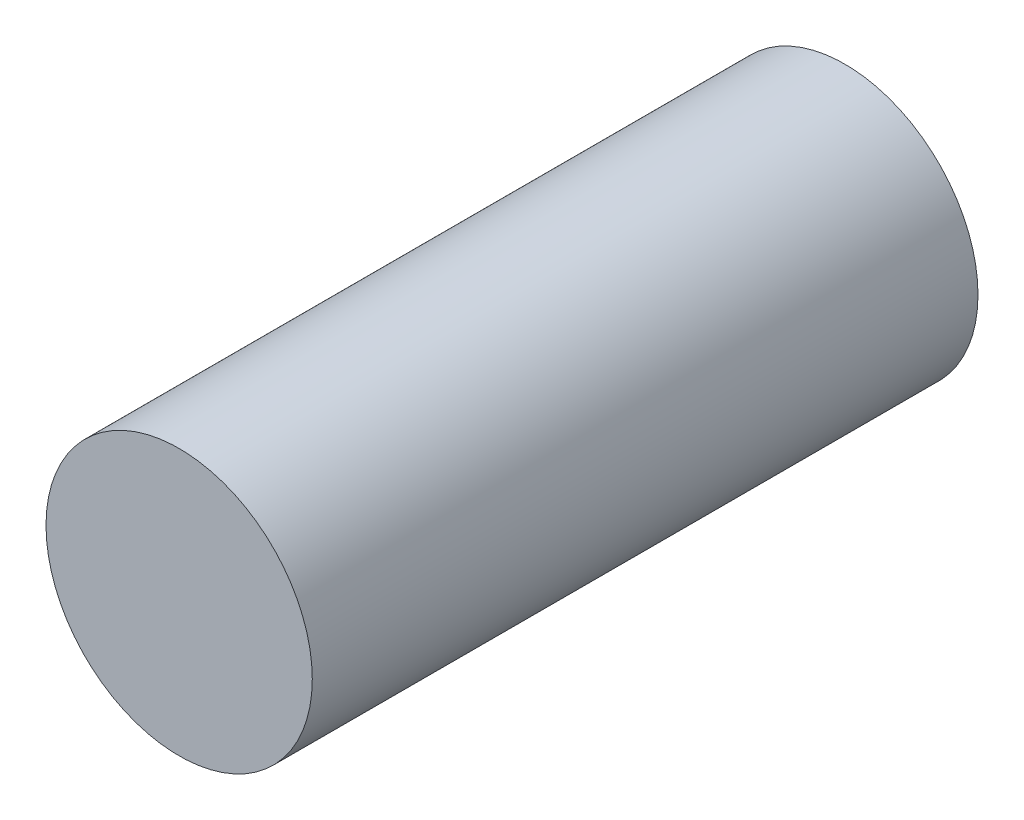
ISO-10303-21;
HEADER;
FILE_DESCRIPTION(('STEP AP214'),'2;1');
FILE_NAME('part.step','',(''),(''),'','','');
FILE_SCHEMA(('AUTOMOTIVE_DESIGN { 1 0 10303 214 1 1 1 1 }'));
ENDSEC;
DATA;
#1=APPLICATION_CONTEXT('core data for automotive mechanical design processes');
#2=APPLICATION_PROTOCOL_DEFINITION('international standard','automotive_design',2000,#1);
#3=PRODUCT_CONTEXT('',#1,'mechanical');
#4=PRODUCT('Part','Part','',(#3));
#5=PRODUCT_RELATED_PRODUCT_CATEGORY('part','',(#4));
#6=PRODUCT_DEFINITION_FORMATION('','',#4);
#7=PRODUCT_DEFINITION_CONTEXT('part definition',#1,'design');
#8=PRODUCT_DEFINITION('design','',#6,#7);
#9=PRODUCT_DEFINITION_SHAPE('','',#8);
#10=(LENGTH_UNIT() NAMED_UNIT(*) SI_UNIT(.MILLI.,.METRE.));
#11=(NAMED_UNIT(*) PLANE_ANGLE_UNIT() SI_UNIT($,.RADIAN.));
#12=(NAMED_UNIT(*) SI_UNIT($,.STERADIAN.) SOLID_ANGLE_UNIT());
#13=UNCERTAINTY_MEASURE_WITH_UNIT(LENGTH_MEASURE(1.E-05),#10,'distance_accuracy_value','');
#14=(GEOMETRIC_REPRESENTATION_CONTEXT(3) GLOBAL_UNCERTAINTY_ASSIGNED_CONTEXT((#13)) GLOBAL_UNIT_ASSIGNED_CONTEXT((#10,
#11,#12)) REPRESENTATION_CONTEXT('',''));
#15=CARTESIAN_POINT('',(0.,0.,0.));
#16=DIRECTION('',(0.,0.,1.));
#17=DIRECTION('',(1.,0.,0.));
#18=AXIS2_PLACEMENT_3D('',#15,#16,#17);
#19=CARTESIAN_POINT('',(0.,0.,10.));
#20=DIRECTION('',(0.,0.,-1.));
#21=DIRECTION('',(-1.,0.,0.));
#22=AXIS2_PLACEMENT_3D('',#19,#20,#21);
#23=CYLINDRICAL_SURFACE('',#22,2.);
#24=CARTESIAN_POINT('',(0.,0.,10.));
#25=DIRECTION('',(0.,0.,1.));
#26=DIRECTION('',(1.,0.,0.));
#27=AXIS2_PLACEMENT_3D('',#24,#25,#26);
#28=CIRCLE('',#27,2.);
#29=CARTESIAN_POINT('',(2.,0.,10.));
#30=VERTEX_POINT('',#29);
#31=EDGE_CURVE('E10',#30,#30,#28,.T.);
#32=ORIENTED_EDGE('',*,*,#31,.F.);
#33=EDGE_LOOP('',(#32));
#34=FACE_BOUND('',#33,.T.);
#35=CARTESIAN_POINT('',(0.,0.,0.));
#36=DIRECTION('',(0.,0.,1.));
#37=DIRECTION('',(1.,0.,0.));
#38=AXIS2_PLACEMENT_3D('',#35,#36,#37);
#39=CIRCLE('',#38,2.);
#40=CARTESIAN_POINT('',(2.,0.,0.));
#41=VERTEX_POINT('',#40);
#42=EDGE_CURVE('E33',#41,#41,#39,.T.);
#43=ORIENTED_EDGE('',*,*,#42,.T.);
#44=EDGE_LOOP('',(#43));
#45=FACE_BOUND('',#44,.T.);
#46=ADVANCED_FACE('F30',(#34,#45),#23,.T.);
#47=CARTESIAN_POINT('',(0.,0.,10.));
#48=DIRECTION('',(0.,0.,1.));
#49=DIRECTION('',(1.,0.,0.));
#50=AXIS2_PLACEMENT_3D('',#47,#48,#49);
#51=PLANE('',#50);
#52=ORIENTED_EDGE('',*,*,#31,.T.);
#53=EDGE_LOOP('',(#52));
#54=FACE_BOUND('',#53,.T.);
#55=ADVANCED_FACE('F45',(#54),#51,.T.);
#56=CARTESIAN_POINT('',(0.,0.,0.));
#57=DIRECTION('',(0.,0.,1.));
#58=DIRECTION('',(1.,0.,0.));
#59=AXIS2_PLACEMENT_3D('',#56,#57,#58);
#60=PLANE('',#59);
#61=ORIENTED_EDGE('',*,*,#42,.F.);
#62=EDGE_LOOP('',(#61));
#63=FACE_BOUND('',#62,.T.);
#64=ADVANCED_FACE('F43',(#63),#60,.F.);
#65=CLOSED_SHELL('',(#46,#55,#64));
#66=MANIFOLD_SOLID_BREP('B2',#65);
#67=ADVANCED_BREP_SHAPE_REPRESENTATION('',(#18,#66),#14);
#68=SHAPE_DEFINITION_REPRESENTATION(#9,#67);
ENDSEC;
END-ISO-10303-21;
